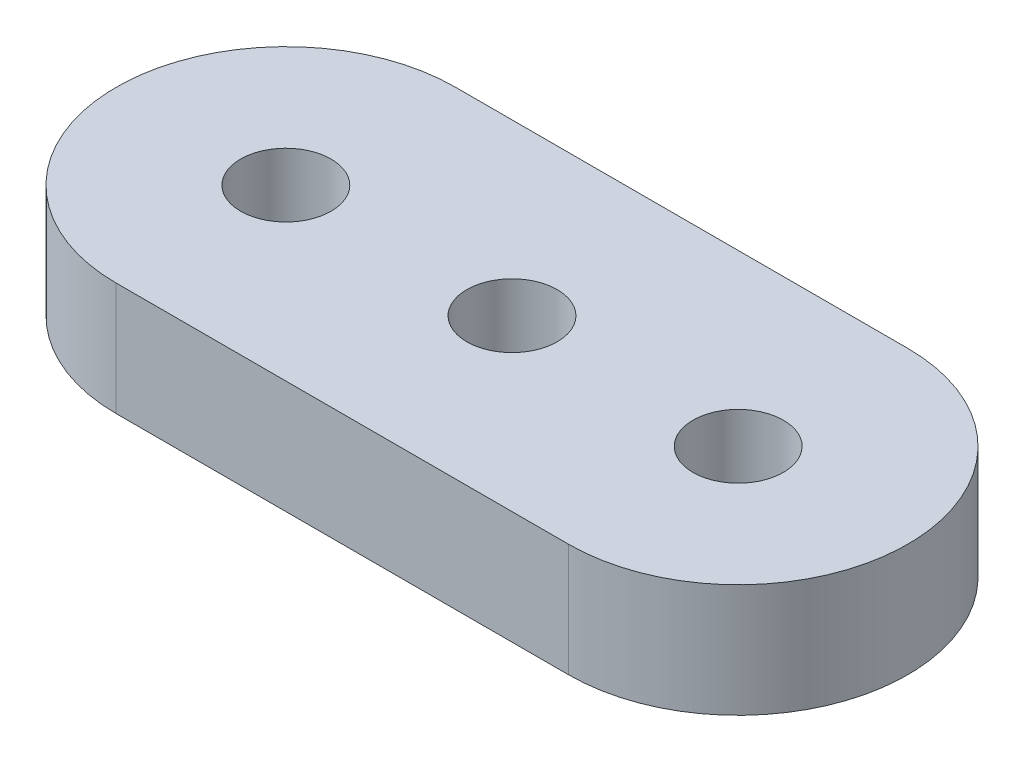
ISO-10303-21;
HEADER;
FILE_DESCRIPTION(('STEP AP214'),'2;1');
FILE_NAME('part.step','',(''),(''),'','','');
FILE_SCHEMA(('AUTOMOTIVE_DESIGN { 1 0 10303 214 1 1 1 1 }'));
ENDSEC;
DATA;
#1=APPLICATION_CONTEXT('core data for automotive mechanical design processes');
#2=APPLICATION_PROTOCOL_DEFINITION('international standard','automotive_design',2000,#1);
#3=PRODUCT_CONTEXT('',#1,'mechanical');
#4=PRODUCT('Part','Part','',(#3));
#5=PRODUCT_RELATED_PRODUCT_CATEGORY('part','',(#4));
#6=PRODUCT_DEFINITION_FORMATION('','',#4);
#7=PRODUCT_DEFINITION_CONTEXT('part definition',#1,'design');
#8=PRODUCT_DEFINITION('design','',#6,#7);
#9=PRODUCT_DEFINITION_SHAPE('','',#8);
#10=(LENGTH_UNIT() NAMED_UNIT(*) SI_UNIT(.MILLI.,.METRE.));
#11=(NAMED_UNIT(*) PLANE_ANGLE_UNIT() SI_UNIT($,.RADIAN.));
#12=(NAMED_UNIT(*) SI_UNIT($,.STERADIAN.) SOLID_ANGLE_UNIT());
#13=UNCERTAINTY_MEASURE_WITH_UNIT(LENGTH_MEASURE(1.E-05),#10,'distance_accuracy_value','');
#14=(GEOMETRIC_REPRESENTATION_CONTEXT(3) GLOBAL_UNCERTAINTY_ASSIGNED_CONTEXT((#13)) GLOBAL_UNIT_ASSIGNED_CONTEXT((#10,
#11,#12)) REPRESENTATION_CONTEXT('',''));
#15=CARTESIAN_POINT('',(0.,0.,0.));
#16=DIRECTION('',(0.,0.,1.));
#17=DIRECTION('',(1.,0.,0.));
#18=AXIS2_PLACEMENT_3D('',#15,#16,#17);
#19=CARTESIAN_POINT('',(0.,2.54,-3.81));
#20=DIRECTION('',(0.,-1.,0.));
#21=DIRECTION('',(0.,0.,-1.));
#22=AXIS2_PLACEMENT_3D('',#19,#20,#21);
#23=CYLINDRICAL_SURFACE('',#22,3.81);
#24=CARTESIAN_POINT('',(0.,0.,-3.81));
#25=DIRECTION('',(0.,1.,0.));
#26=DIRECTION('',(0.,0.,-1.));
#27=AXIS2_PLACEMENT_3D('',#24,#25,#26);
#28=CIRCLE('',#27,3.81);
#29=CARTESIAN_POINT('',(0.,0.,-7.62));
#30=VERTEX_POINT('',#29);
#31=CARTESIAN_POINT('',(0.,0.,0.));
#32=VERTEX_POINT('',#31);
#33=EDGE_CURVE('E102',#30,#32,#28,.T.);
#34=ORIENTED_EDGE('',*,*,#33,.T.);
#35=DIRECTION('',(0.,-1.,0.));
#36=VECTOR('',#35,1.);
#37=CARTESIAN_POINT('',(0.,2.54,0.));
#38=LINE('',#37,#36);
#39=CARTESIAN_POINT('',(0.,2.54,0.));
#40=VERTEX_POINT('',#39);
#41=EDGE_CURVE('E11',#40,#32,#38,.T.);
#42=ORIENTED_EDGE('',*,*,#41,.F.);
#43=CARTESIAN_POINT('',(0.,2.54,-3.81));
#44=DIRECTION('',(0.,1.,0.));
#45=DIRECTION('',(0.,0.,-1.));
#46=AXIS2_PLACEMENT_3D('',#43,#44,#45);
#47=CIRCLE('',#46,3.81);
#48=CARTESIAN_POINT('',(0.,2.54,-7.62));
#49=VERTEX_POINT('',#48);
#50=EDGE_CURVE('E90',#49,#40,#47,.T.);
#51=ORIENTED_EDGE('',*,*,#50,.F.);
#52=DIRECTION('',(0.,-1.,0.));
#53=VECTOR('',#52,1.);
#54=CARTESIAN_POINT('',(0.,2.54,-7.62));
#55=LINE('',#54,#53);
#56=EDGE_CURVE('E98',#49,#30,#55,.T.);
#57=ORIENTED_EDGE('',*,*,#56,.T.);
#58=EDGE_LOOP('',(#34,#42,#51,#57));
#59=FACE_BOUND('',#58,.T.);
#60=ADVANCED_FACE('F39',(#59),#23,.T.);
#61=CARTESIAN_POINT('',(0.,2.54,0.));
#62=DIRECTION('',(0.,0.,-1.));
#63=DIRECTION('',(-1.,0.,0.));
#64=AXIS2_PLACEMENT_3D('',#61,#62,#63);
#65=PLANE('',#64);
#66=DIRECTION('',(1.,0.,0.));
#67=VECTOR('',#66,1.);
#68=CARTESIAN_POINT('',(0.,0.,0.));
#69=LINE('',#68,#67);
#70=CARTESIAN_POINT('',(10.16,0.,0.));
#71=VERTEX_POINT('',#70);
#72=EDGE_CURVE('E94',#32,#71,#69,.T.);
#73=ORIENTED_EDGE('',*,*,#72,.T.);
#74=DIRECTION('',(0.,-1.,0.));
#75=VECTOR('',#74,1.);
#76=CARTESIAN_POINT('',(10.16,2.54,0.));
#77=LINE('',#76,#75);
#78=CARTESIAN_POINT('',(10.16,2.54,0.));
#79=VERTEX_POINT('',#78);
#80=EDGE_CURVE('E47',#79,#71,#77,.T.);
#81=ORIENTED_EDGE('',*,*,#80,.F.);
#82=DIRECTION('',(1.,0.,0.));
#83=VECTOR('',#82,1.);
#84=CARTESIAN_POINT('',(0.,2.54,0.));
#85=LINE('',#84,#83);
#86=EDGE_CURVE('E85',#40,#79,#85,.T.);
#87=ORIENTED_EDGE('',*,*,#86,.F.);
#88=ORIENTED_EDGE('',*,*,#41,.T.);
#89=EDGE_LOOP('',(#73,#81,#87,#88));
#90=FACE_BOUND('',#89,.T.);
#91=ADVANCED_FACE('F93',(#90),#65,.F.);
#92=CARTESIAN_POINT('',(10.16,2.54,-3.81));
#93=DIRECTION('',(0.,-1.,0.));
#94=DIRECTION('',(0.,0.,-1.));
#95=AXIS2_PLACEMENT_3D('',#92,#93,#94);
#96=CYLINDRICAL_SURFACE('',#95,3.81);
#97=CARTESIAN_POINT('',(10.16,0.,-3.81));
#98=DIRECTION('',(0.,1.,0.));
#99=DIRECTION('',(0.,0.,-1.));
#100=AXIS2_PLACEMENT_3D('',#97,#98,#99);
#101=CIRCLE('',#100,3.81);
#102=CARTESIAN_POINT('',(10.16,0.,-7.62));
#103=VERTEX_POINT('',#102);
#104=EDGE_CURVE('E72',#71,#103,#101,.T.);
#105=ORIENTED_EDGE('',*,*,#104,.T.);
#106=DIRECTION('',(0.,-1.,0.));
#107=VECTOR('',#106,1.);
#108=CARTESIAN_POINT('',(10.16,2.54,-7.62));
#109=LINE('',#108,#107);
#110=CARTESIAN_POINT('',(10.16,2.54,-7.62));
#111=VERTEX_POINT('',#110);
#112=EDGE_CURVE('E95',#111,#103,#109,.T.);
#113=ORIENTED_EDGE('',*,*,#112,.F.);
#114=CARTESIAN_POINT('',(10.16,2.54,-3.81));
#115=DIRECTION('',(0.,1.,0.));
#116=DIRECTION('',(0.,0.,-1.));
#117=AXIS2_PLACEMENT_3D('',#114,#115,#116);
#118=CIRCLE('',#117,3.81);
#119=EDGE_CURVE('E88',#79,#111,#118,.T.);
#120=ORIENTED_EDGE('',*,*,#119,.F.);
#121=ORIENTED_EDGE('',*,*,#80,.T.);
#122=EDGE_LOOP('',(#105,#113,#120,#121));
#123=FACE_BOUND('',#122,.T.);
#124=ADVANCED_FACE('F96',(#123),#96,.T.);
#125=CARTESIAN_POINT('',(0.,2.54,-7.62));
#126=DIRECTION('',(0.,0.,1.));
#127=DIRECTION('',(1.,0.,0.));
#128=AXIS2_PLACEMENT_3D('',#125,#126,#127);
#129=PLANE('',#128);
#130=DIRECTION('',(-1.,0.,0.));
#131=VECTOR('',#130,1.);
#132=CARTESIAN_POINT('',(0.,0.,-7.62));
#133=LINE('',#132,#131);
#134=EDGE_CURVE('E78',#103,#30,#133,.T.);
#135=ORIENTED_EDGE('',*,*,#134,.T.);
#136=ORIENTED_EDGE('',*,*,#56,.F.);
#137=DIRECTION('',(-1.,0.,0.));
#138=VECTOR('',#137,1.);
#139=CARTESIAN_POINT('',(0.,2.54,-7.62));
#140=LINE('',#139,#138);
#141=EDGE_CURVE('E55',#111,#49,#140,.T.);
#142=ORIENTED_EDGE('',*,*,#141,.F.);
#143=ORIENTED_EDGE('',*,*,#112,.T.);
#144=EDGE_LOOP('',(#135,#136,#142,#143));
#145=FACE_BOUND('',#144,.T.);
#146=ADVANCED_FACE('F110',(#145),#129,.F.);
#147=CARTESIAN_POINT('',(0.,2.54,-3.81));
#148=DIRECTION('',(0.,-1.,0.));
#149=DIRECTION('',(0.,0.,-1.));
#150=AXIS2_PLACEMENT_3D('',#147,#148,#149);
#151=PLANE('',#150);
#152=CARTESIAN_POINT('',(0.,2.54,-3.81));
#153=DIRECTION('',(0.,1.,0.));
#154=DIRECTION('',(0.,0.,1.));
#155=AXIS2_PLACEMENT_3D('',#152,#153,#154);
#156=CIRCLE('',#155,1.016);
#157=CARTESIAN_POINT('',(0.,2.54,-2.794));
#158=VERTEX_POINT('',#157);
#159=EDGE_CURVE('E128',#158,#158,#156,.T.);
#160=ORIENTED_EDGE('',*,*,#159,.F.);
#161=EDGE_LOOP('',(#160));
#162=FACE_BOUND('',#161,.T.);
#163=CARTESIAN_POINT('',(5.08,2.54,-3.81));
#164=DIRECTION('',(0.,1.,0.));
#165=DIRECTION('',(0.,0.,1.));
#166=AXIS2_PLACEMENT_3D('',#163,#164,#165);
#167=CIRCLE('',#166,1.016);
#168=CARTESIAN_POINT('',(5.08,2.54,-2.794));
#169=VERTEX_POINT('',#168);
#170=EDGE_CURVE('E125',#169,#169,#167,.T.);
#171=ORIENTED_EDGE('',*,*,#170,.F.);
#172=EDGE_LOOP('',(#171));
#173=FACE_BOUND('',#172,.T.);
#174=CARTESIAN_POINT('',(10.16,2.54,-3.81));
#175=DIRECTION('',(0.,1.,0.));
#176=DIRECTION('',(0.,0.,1.));
#177=AXIS2_PLACEMENT_3D('',#174,#175,#176);
#178=CIRCLE('',#177,1.016);
#179=CARTESIAN_POINT('',(10.16,2.54,-2.794));
#180=VERTEX_POINT('',#179);
#181=EDGE_CURVE('E119',#180,#180,#178,.T.);
#182=ORIENTED_EDGE('',*,*,#181,.F.);
#183=EDGE_LOOP('',(#182));
#184=FACE_BOUND('',#183,.T.);
#185=ORIENTED_EDGE('',*,*,#50,.T.);
#186=ORIENTED_EDGE('',*,*,#86,.T.);
#187=ORIENTED_EDGE('',*,*,#119,.T.);
#188=ORIENTED_EDGE('',*,*,#141,.T.);
#189=EDGE_LOOP('',(#185,#186,#187,#188));
#190=FACE_BOUND('',#189,.T.);
#191=ADVANCED_FACE('F86',(#162,#173,#184,#190),#151,.F.);
#192=CARTESIAN_POINT('',(0.,0.,-3.81));
#193=DIRECTION('',(0.,-1.,0.));
#194=DIRECTION('',(0.,0.,-1.));
#195=AXIS2_PLACEMENT_3D('',#192,#193,#194);
#196=PLANE('',#195);
#197=CARTESIAN_POINT('',(0.,0.,-3.81));
#198=DIRECTION('',(0.,1.,0.));
#199=DIRECTION('',(0.,0.,1.));
#200=AXIS2_PLACEMENT_3D('',#197,#198,#199);
#201=CIRCLE('',#200,1.016);
#202=CARTESIAN_POINT('',(0.,0.,-2.794));
#203=VERTEX_POINT('',#202);
#204=EDGE_CURVE('E105',#203,#203,#201,.T.);
#205=ORIENTED_EDGE('',*,*,#204,.T.);
#206=EDGE_LOOP('',(#205));
#207=FACE_BOUND('',#206,.T.);
#208=CARTESIAN_POINT('',(5.08,0.,-3.81));
#209=DIRECTION('',(0.,1.,0.));
#210=DIRECTION('',(0.,0.,1.));
#211=AXIS2_PLACEMENT_3D('',#208,#209,#210);
#212=CIRCLE('',#211,1.016);
#213=CARTESIAN_POINT('',(5.08,0.,-2.794));
#214=VERTEX_POINT('',#213);
#215=EDGE_CURVE('E122',#214,#214,#212,.T.);
#216=ORIENTED_EDGE('',*,*,#215,.T.);
#217=EDGE_LOOP('',(#216));
#218=FACE_BOUND('',#217,.T.);
#219=CARTESIAN_POINT('',(10.16,0.,-3.81));
#220=DIRECTION('',(0.,1.,0.));
#221=DIRECTION('',(0.,0.,1.));
#222=AXIS2_PLACEMENT_3D('',#219,#220,#221);
#223=CIRCLE('',#222,1.016);
#224=CARTESIAN_POINT('',(10.16,0.,-2.794));
#225=VERTEX_POINT('',#224);
#226=EDGE_CURVE('E116',#225,#225,#223,.T.);
#227=ORIENTED_EDGE('',*,*,#226,.T.);
#228=EDGE_LOOP('',(#227));
#229=FACE_BOUND('',#228,.T.);
#230=ORIENTED_EDGE('',*,*,#33,.F.);
#231=ORIENTED_EDGE('',*,*,#134,.F.);
#232=ORIENTED_EDGE('',*,*,#104,.F.);
#233=ORIENTED_EDGE('',*,*,#72,.F.);
#234=EDGE_LOOP('',(#230,#231,#232,#233));
#235=FACE_BOUND('',#234,.T.);
#236=ADVANCED_FACE('F113',(#207,#218,#229,#235),#196,.T.);
#237=CARTESIAN_POINT('',(10.16,0.,-3.81));
#238=DIRECTION('',(0.,1.,0.));
#239=DIRECTION('',(0.,0.,1.));
#240=AXIS2_PLACEMENT_3D('',#237,#238,#239);
#241=CYLINDRICAL_SURFACE('',#240,1.016);
#242=ORIENTED_EDGE('',*,*,#226,.F.);
#243=EDGE_LOOP('',(#242));
#244=FACE_BOUND('',#243,.T.);
#245=ORIENTED_EDGE('',*,*,#181,.T.);
#246=EDGE_LOOP('',(#245));
#247=FACE_BOUND('',#246,.T.);
#248=ADVANCED_FACE('F150',(#244,#247),#241,.F.);
#249=CARTESIAN_POINT('',(5.08,0.,-3.81));
#250=DIRECTION('',(0.,1.,0.));
#251=DIRECTION('',(0.,0.,1.));
#252=AXIS2_PLACEMENT_3D('',#249,#250,#251);
#253=CYLINDRICAL_SURFACE('',#252,1.016);
#254=ORIENTED_EDGE('',*,*,#215,.F.);
#255=EDGE_LOOP('',(#254));
#256=FACE_BOUND('',#255,.T.);
#257=ORIENTED_EDGE('',*,*,#170,.T.);
#258=EDGE_LOOP('',(#257));
#259=FACE_BOUND('',#258,.T.);
#260=ADVANCED_FACE('F139',(#256,#259),#253,.F.);
#261=CARTESIAN_POINT('',(0.,0.,-3.81));
#262=DIRECTION('',(0.,1.,0.));
#263=DIRECTION('',(0.,0.,1.));
#264=AXIS2_PLACEMENT_3D('',#261,#262,#263);
#265=CYLINDRICAL_SURFACE('',#264,1.016);
#266=ORIENTED_EDGE('',*,*,#204,.F.);
#267=EDGE_LOOP('',(#266));
#268=FACE_BOUND('',#267,.T.);
#269=ORIENTED_EDGE('',*,*,#159,.T.);
#270=EDGE_LOOP('',(#269));
#271=FACE_BOUND('',#270,.T.);
#272=ADVANCED_FACE('F136',(#268,#271),#265,.F.);
#273=CLOSED_SHELL('',(#60,#91,#124,#146,#191,#236,#248,#260,#272));
#274=MANIFOLD_SOLID_BREP('B2',#273);
#275=ADVANCED_BREP_SHAPE_REPRESENTATION('',(#18,#274),#14);
#276=SHAPE_DEFINITION_REPRESENTATION(#9,#275);
ENDSEC;
END-ISO-10303-21;
